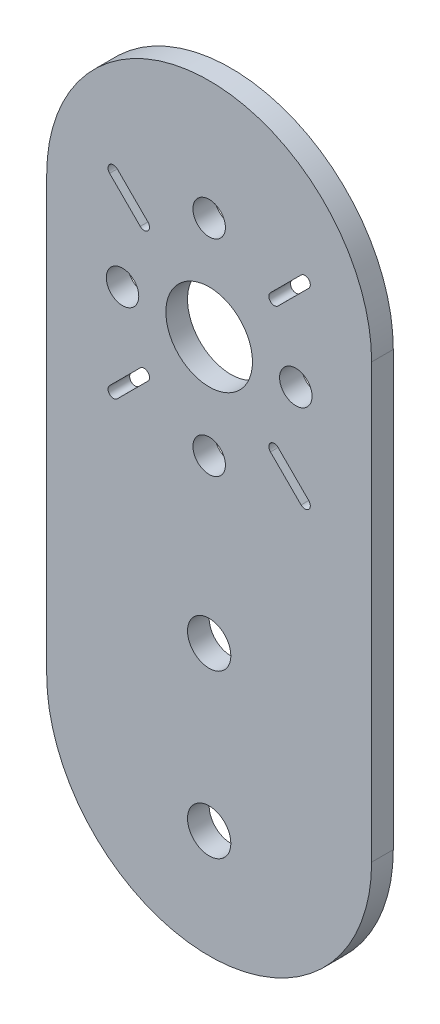
ISO-10303-21;
HEADER;
FILE_DESCRIPTION(('STEP AP214'),'2;1');
FILE_NAME('part.step','',(''),(''),'','','');
FILE_SCHEMA(('AUTOMOTIVE_DESIGN { 1 0 10303 214 1 1 1 1 }'));
ENDSEC;
DATA;
#1=APPLICATION_CONTEXT('core data for automotive mechanical design processes');
#2=APPLICATION_PROTOCOL_DEFINITION('international standard','automotive_design',2000,#1);
#3=PRODUCT_CONTEXT('',#1,'mechanical');
#4=PRODUCT('Part','Part','',(#3));
#5=PRODUCT_RELATED_PRODUCT_CATEGORY('part','',(#4));
#6=PRODUCT_DEFINITION_FORMATION('','',#4);
#7=PRODUCT_DEFINITION_CONTEXT('part definition',#1,'design');
#8=PRODUCT_DEFINITION('design','',#6,#7);
#9=PRODUCT_DEFINITION_SHAPE('','',#8);
#10=(LENGTH_UNIT() NAMED_UNIT(*) SI_UNIT(.MILLI.,.METRE.));
#11=(NAMED_UNIT(*) PLANE_ANGLE_UNIT() SI_UNIT($,.RADIAN.));
#12=(NAMED_UNIT(*) SI_UNIT($,.STERADIAN.) SOLID_ANGLE_UNIT());
#13=UNCERTAINTY_MEASURE_WITH_UNIT(LENGTH_MEASURE(1.E-05),#10,'distance_accuracy_value','');
#14=(GEOMETRIC_REPRESENTATION_CONTEXT(3) GLOBAL_UNCERTAINTY_ASSIGNED_CONTEXT((#13)) GLOBAL_UNIT_ASSIGNED_CONTEXT((#10,
#11,#12)) REPRESENTATION_CONTEXT('',''));
#15=CARTESIAN_POINT('',(0.,0.,0.));
#16=DIRECTION('',(0.,0.,1.));
#17=DIRECTION('',(1.,0.,0.));
#18=AXIS2_PLACEMENT_3D('',#15,#16,#17);
#19=CARTESIAN_POINT('',(0.,-20.,2.));
#20=DIRECTION('',(0.,0.,1.));
#21=DIRECTION('',(1.,0.,0.));
#22=AXIS2_PLACEMENT_3D('',#19,#20,#21);
#23=PLANE('',#22);
#24=CARTESIAN_POINT('',(8.,14.5,2.));
#25=DIRECTION('',(0.,0.,1.));
#26=DIRECTION('',(1.,0.,0.));
#27=AXIS2_PLACEMENT_3D('',#24,#25,#26);
#28=CIRCLE('',#27,1.5);
#29=CARTESIAN_POINT('',(9.5,14.5,2.));
#30=VERTEX_POINT('',#29);
#31=EDGE_CURVE('E362',#30,#30,#28,.T.);
#32=ORIENTED_EDGE('',*,*,#31,.F.);
#33=EDGE_LOOP('',(#32));
#34=FACE_BOUND('',#33,.T.);
#35=CARTESIAN_POINT('',(0.,24.,2.));
#36=DIRECTION('',(0.,0.,1.));
#37=DIRECTION('',(1.,0.,0.));
#38=AXIS2_PLACEMENT_3D('',#35,#36,#37);
#39=CIRCLE('',#38,1.5);
#40=CARTESIAN_POINT('',(1.5,24.,2.));
#41=VERTEX_POINT('',#40);
#42=EDGE_CURVE('E378',#41,#41,#39,.T.);
#43=ORIENTED_EDGE('',*,*,#42,.F.);
#44=EDGE_LOOP('',(#43));
#45=FACE_BOUND('',#44,.T.);
#46=CARTESIAN_POINT('',(0.,-10.,2.));
#47=DIRECTION('',(0.,0.,1.));
#48=DIRECTION('',(1.,0.,0.));
#49=AXIS2_PLACEMENT_3D('',#46,#47,#48);
#50=CIRCLE('',#49,2.);
#51=CARTESIAN_POINT('',(2.,-10.,2.));
#52=VERTEX_POINT('',#51);
#53=EDGE_CURVE('E394',#52,#52,#50,.T.);
#54=ORIENTED_EDGE('',*,*,#53,.F.);
#55=EDGE_LOOP('',(#54));
#56=FACE_BOUND('',#55,.T.);
#57=CARTESIAN_POINT('',(0.,-20.,2.));
#58=DIRECTION('',(0.,0.,1.));
#59=DIRECTION('',(1.,0.,0.));
#60=AXIS2_PLACEMENT_3D('',#57,#58,#59);
#61=CIRCLE('',#60,15.);
#62=CARTESIAN_POINT('',(-15.,-20.,2.));
#63=VERTEX_POINT('',#62);
#64=CARTESIAN_POINT('',(15.,-20.,2.));
#65=VERTEX_POINT('',#64);
#66=EDGE_CURVE('E410',#63,#65,#61,.T.);
#67=ORIENTED_EDGE('',*,*,#66,.T.);
#68=DIRECTION('',(0.,1.,0.));
#69=VECTOR('',#68,1.);
#70=CARTESIAN_POINT('',(15.,20.,2.));
#71=LINE('',#70,#69);
#72=CARTESIAN_POINT('',(15.,20.,2.));
#73=VERTEX_POINT('',#72);
#74=EDGE_CURVE('E414',#65,#73,#71,.T.);
#75=ORIENTED_EDGE('',*,*,#74,.T.);
#76=CARTESIAN_POINT('',(0.,20.,2.));
#77=DIRECTION('',(0.,0.,1.));
#78=DIRECTION('',(1.,0.,0.));
#79=AXIS2_PLACEMENT_3D('',#76,#77,#78);
#80=CIRCLE('',#79,15.);
#81=CARTESIAN_POINT('',(-15.,20.,2.));
#82=VERTEX_POINT('',#81);
#83=EDGE_CURVE('E418',#73,#82,#80,.T.);
#84=ORIENTED_EDGE('',*,*,#83,.T.);
#85=DIRECTION('',(0.,-1.,0.));
#86=VECTOR('',#85,1.);
#87=CARTESIAN_POINT('',(-15.,20.,2.));
#88=LINE('',#87,#86);
#89=EDGE_CURVE('E421',#82,#63,#88,.T.);
#90=ORIENTED_EDGE('',*,*,#89,.T.);
#91=EDGE_LOOP('',(#67,#75,#84,#90));
#92=FACE_BOUND('',#91,.T.);
#93=CARTESIAN_POINT('',(0.,-25.,2.));
#94=DIRECTION('',(0.,0.,1.));
#95=DIRECTION('',(1.,0.,0.));
#96=AXIS2_PLACEMENT_3D('',#93,#94,#95);
#97=CIRCLE('',#96,2.);
#98=CARTESIAN_POINT('',(2.,-25.,2.));
#99=VERTEX_POINT('',#98);
#100=EDGE_CURVE('E402',#99,#99,#97,.T.);
#101=ORIENTED_EDGE('',*,*,#100,.F.);
#102=EDGE_LOOP('',(#101));
#103=FACE_BOUND('',#102,.T.);
#104=CARTESIAN_POINT('',(0.,5.,2.));
#105=DIRECTION('',(0.,0.,1.));
#106=DIRECTION('',(1.,0.,0.));
#107=AXIS2_PLACEMENT_3D('',#104,#105,#106);
#108=CIRCLE('',#107,1.5);
#109=CARTESIAN_POINT('',(1.5,5.,2.));
#110=VERTEX_POINT('',#109);
#111=EDGE_CURVE('E386',#110,#110,#108,.T.);
#112=ORIENTED_EDGE('',*,*,#111,.F.);
#113=EDGE_LOOP('',(#112));
#114=FACE_BOUND('',#113,.T.);
#115=CARTESIAN_POINT('',(-8.,14.5,2.));
#116=DIRECTION('',(0.,0.,1.));
#117=DIRECTION('',(1.,0.,0.));
#118=AXIS2_PLACEMENT_3D('',#115,#116,#117);
#119=CIRCLE('',#118,1.5);
#120=CARTESIAN_POINT('',(-6.5,14.5,2.));
#121=VERTEX_POINT('',#120);
#122=EDGE_CURVE('E370',#121,#121,#119,.T.);
#123=ORIENTED_EDGE('',*,*,#122,.F.);
#124=EDGE_LOOP('',(#123));
#125=FACE_BOUND('',#124,.T.);
#126=CARTESIAN_POINT('',(0.,14.5,2.));
#127=DIRECTION('',(0.,0.,1.));
#128=DIRECTION('',(1.,0.,0.));
#129=AXIS2_PLACEMENT_3D('',#126,#127,#128);
#130=CIRCLE('',#129,4.);
#131=CARTESIAN_POINT('',(4.,14.5,2.));
#132=VERTEX_POINT('',#131);
#133=EDGE_CURVE('E354',#132,#132,#130,.T.);
#134=ORIENTED_EDGE('',*,*,#133,.F.);
#135=EDGE_LOOP('',(#134));
#136=FACE_BOUND('',#135,.T.);
#137=DIRECTION('',(0.707106781186548,0.707106781186547,0.));
#138=VECTOR('',#137,1.);
#139=CARTESIAN_POINT('',(6.36396103067893,20.1568542494924,2.));
#140=LINE('',#139,#138);
#141=CARTESIAN_POINT('',(6.36396103067893,20.1568542494924,2.));
#142=VERTEX_POINT('',#141);
#143=CARTESIAN_POINT('',(9.19238815542512,22.9852813742386,2.));
#144=VERTEX_POINT('',#143);
#145=EDGE_CURVE('E314',#142,#144,#140,.T.);
#146=ORIENTED_EDGE('',*,*,#145,.F.);
#147=CARTESIAN_POINT('',(6.01040764008565,20.5104076400856,2.));
#148=DIRECTION('',(0.,0.,1.));
#149=DIRECTION('',(1.,0.,0.));
#150=AXIS2_PLACEMENT_3D('',#147,#148,#149);
#151=CIRCLE('',#150,0.500000000000001);
#152=CARTESIAN_POINT('',(5.65685424949238,20.8639610306789,2.));
#153=VERTEX_POINT('',#152);
#154=EDGE_CURVE('E311',#153,#142,#151,.T.);
#155=ORIENTED_EDGE('',*,*,#154,.F.);
#156=DIRECTION('',(-0.707106781186548,-0.707106781186547,0.));
#157=VECTOR('',#156,1.);
#158=CARTESIAN_POINT('',(5.65685424949238,20.8639610306789,2.));
#159=LINE('',#158,#157);
#160=CARTESIAN_POINT('',(8.48528137423857,23.6923881554251,2.));
#161=VERTEX_POINT('',#160);
#162=EDGE_CURVE('E322',#161,#153,#159,.T.);
#163=ORIENTED_EDGE('',*,*,#162,.F.);
#164=CARTESIAN_POINT('',(8.83883476483185,23.3388347648318,2.));
#165=DIRECTION('',(0.,0.,1.));
#166=DIRECTION('',(1.,0.,0.));
#167=AXIS2_PLACEMENT_3D('',#164,#165,#166);
#168=CIRCLE('',#167,0.500000000000001);
#169=EDGE_CURVE('E318',#144,#161,#168,.T.);
#170=ORIENTED_EDGE('',*,*,#169,.F.);
#171=EDGE_LOOP('',(#146,#155,#163,#170));
#172=FACE_BOUND('',#171,.T.);
#173=DIRECTION('',(0.707106781186545,-0.70710678118655,0.));
#174=VECTOR('',#173,1.);
#175=CARTESIAN_POINT('',(5.65685424949252,8.13603896932105,2.));
#176=LINE('',#175,#174);
#177=CARTESIAN_POINT('',(5.65685424949252,8.13603896932105,2.));
#178=VERTEX_POINT('',#177);
#179=CARTESIAN_POINT('',(8.4852813742387,5.30761184457485,2.));
#180=VERTEX_POINT('',#179);
#181=EDGE_CURVE('E271',#178,#180,#176,.T.);
#182=ORIENTED_EDGE('',*,*,#181,.F.);
#183=CARTESIAN_POINT('',(6.01040764008579,8.48959235991432,2.));
#184=DIRECTION('',(0.,0.,1.));
#185=DIRECTION('',(1.,0.,0.));
#186=AXIS2_PLACEMENT_3D('',#183,#184,#185);
#187=CIRCLE('',#186,0.499999999999999);
#188=CARTESIAN_POINT('',(6.36396103067907,8.84314575050759,2.));
#189=VERTEX_POINT('',#188);
#190=EDGE_CURVE('E268',#189,#178,#187,.T.);
#191=ORIENTED_EDGE('',*,*,#190,.F.);
#192=DIRECTION('',(-0.707106781186545,0.70710678118655,0.));
#193=VECTOR('',#192,1.);
#194=CARTESIAN_POINT('',(6.36396103067907,8.84314575050759,2.));
#195=LINE('',#194,#193);
#196=CARTESIAN_POINT('',(9.19238815542525,6.01471862576139,2.));
#197=VERTEX_POINT('',#196);
#198=EDGE_CURVE('E279',#197,#189,#195,.T.);
#199=ORIENTED_EDGE('',*,*,#198,.F.);
#200=CARTESIAN_POINT('',(8.83883476483197,5.66116523516812,2.));
#201=DIRECTION('',(0.,0.,1.));
#202=DIRECTION('',(1.,0.,0.));
#203=AXIS2_PLACEMENT_3D('',#200,#201,#202);
#204=CIRCLE('',#203,0.499999999999999);
#205=EDGE_CURVE('E275',#180,#197,#204,.T.);
#206=ORIENTED_EDGE('',*,*,#205,.F.);
#207=EDGE_LOOP('',(#182,#191,#199,#206));
#208=FACE_BOUND('',#207,.T.);
#209=DIRECTION('',(-0.707106781186553,-0.707106781186542,0.));
#210=VECTOR('',#209,1.);
#211=CARTESIAN_POINT('',(-6.36396103067881,8.8431457505075,2.));
#212=LINE('',#211,#210);
#213=CARTESIAN_POINT('',(-6.36396103067881,8.8431457505075,2.));
#214=VERTEX_POINT('',#213);
#215=CARTESIAN_POINT('',(-9.19238815542502,6.01471862576133,2.));
#216=VERTEX_POINT('',#215);
#217=EDGE_CURVE('E228',#214,#216,#212,.T.);
#218=ORIENTED_EDGE('',*,*,#217,.F.);
#219=CARTESIAN_POINT('',(-6.01040764008554,8.48959235991422,2.));
#220=DIRECTION('',(0.,0.,1.));
#221=DIRECTION('',(1.,0.,0.));
#222=AXIS2_PLACEMENT_3D('',#219,#220,#221);
#223=CIRCLE('',#222,0.500000000000001);
#224=CARTESIAN_POINT('',(-5.65685424949226,8.13603896932094,2.));
#225=VERTEX_POINT('',#224);
#226=EDGE_CURVE('E225',#225,#214,#223,.T.);
#227=ORIENTED_EDGE('',*,*,#226,.F.);
#228=DIRECTION('',(0.707106781186553,0.707106781186542,0.));
#229=VECTOR('',#228,1.);
#230=CARTESIAN_POINT('',(-5.65685424949226,8.13603896932094,2.));
#231=LINE('',#230,#229);
#232=CARTESIAN_POINT('',(-8.48528137423847,5.30761184457478,2.));
#233=VERTEX_POINT('',#232);
#234=EDGE_CURVE('E236',#233,#225,#231,.T.);
#235=ORIENTED_EDGE('',*,*,#234,.F.);
#236=CARTESIAN_POINT('',(-8.83883476483175,5.66116523516805,2.));
#237=DIRECTION('',(0.,0.,1.));
#238=DIRECTION('',(1.,0.,0.));
#239=AXIS2_PLACEMENT_3D('',#236,#237,#238);
#240=CIRCLE('',#239,0.500000000000002);
#241=EDGE_CURVE('E232',#216,#233,#240,.T.);
#242=ORIENTED_EDGE('',*,*,#241,.F.);
#243=EDGE_LOOP('',(#218,#227,#235,#242));
#244=FACE_BOUND('',#243,.T.);
#245=DIRECTION('',(-0.70710678118654,0.707106781186555,0.));
#246=VECTOR('',#245,1.);
#247=CARTESIAN_POINT('',(-5.65685424949232,20.8639610306788,2.));
#248=LINE('',#247,#246);
#249=CARTESIAN_POINT('',(-5.65685424949232,20.8639610306788,2.));
#250=VERTEX_POINT('',#249);
#251=CARTESIAN_POINT('',(-8.48528137423847,23.692388155425,2.));
#252=VERTEX_POINT('',#251);
#253=EDGE_CURVE('E186',#250,#252,#248,.T.);
#254=ORIENTED_EDGE('',*,*,#253,.F.);
#255=CARTESIAN_POINT('',(-6.01040764008559,20.5104076400856,2.));
#256=DIRECTION('',(0.,0.,1.));
#257=DIRECTION('',(1.,0.,0.));
#258=AXIS2_PLACEMENT_3D('',#255,#256,#257);
#259=CIRCLE('',#258,0.499999999999999);
#260=CARTESIAN_POINT('',(-6.36396103067887,20.1568542494923,2.));
#261=VERTEX_POINT('',#260);
#262=EDGE_CURVE('E177',#261,#250,#259,.T.);
#263=ORIENTED_EDGE('',*,*,#262,.F.);
#264=DIRECTION('',(0.70710678118654,-0.707106781186555,0.));
#265=VECTOR('',#264,1.);
#266=CARTESIAN_POINT('',(-6.36396103067887,20.1568542494923,2.));
#267=LINE('',#266,#265);
#268=CARTESIAN_POINT('',(-9.19238815542503,22.9852813742385,2.));
#269=VERTEX_POINT('',#268);
#270=EDGE_CURVE('E203',#269,#261,#267,.T.);
#271=ORIENTED_EDGE('',*,*,#270,.F.);
#272=CARTESIAN_POINT('',(-8.83883476483175,23.3388347648318,2.));
#273=DIRECTION('',(0.,0.,1.));
#274=DIRECTION('',(1.,0.,0.));
#275=AXIS2_PLACEMENT_3D('',#272,#273,#274);
#276=CIRCLE('',#275,0.499999999999999);
#277=EDGE_CURVE('E199',#252,#269,#276,.T.);
#278=ORIENTED_EDGE('',*,*,#277,.F.);
#279=EDGE_LOOP('',(#254,#263,#271,#278));
#280=FACE_BOUND('',#279,.T.);
#281=ADVANCED_FACE('F39',(#34,#45,#56,#92,#103,#114,#125,#136,#172,#208,#244,#280),#23,.T.);
#282=CARTESIAN_POINT('',(0.,-20.,0.));
#283=DIRECTION('',(0.,0.,1.));
#284=DIRECTION('',(1.,0.,0.));
#285=AXIS2_PLACEMENT_3D('',#282,#283,#284);
#286=PLANE('',#285);
#287=CARTESIAN_POINT('',(-6.01040764008554,8.48959235991422,0.));
#288=DIRECTION('',(0.,0.,1.));
#289=DIRECTION('',(1.,0.,0.));
#290=AXIS2_PLACEMENT_3D('',#287,#288,#289);
#291=CIRCLE('',#290,0.500000000000001);
#292=CARTESIAN_POINT('',(-5.65685424949227,8.13603896932094,0.));
#293=VERTEX_POINT('',#292);
#294=CARTESIAN_POINT('',(-6.36396103067881,8.8431457505075,0.));
#295=VERTEX_POINT('',#294);
#296=EDGE_CURVE('E195',#293,#295,#291,.T.);
#297=ORIENTED_EDGE('',*,*,#296,.T.);
#298=DIRECTION('',(-0.707106781186553,-0.707106781186542,0.));
#299=VECTOR('',#298,1.);
#300=CARTESIAN_POINT('',(-6.36396103067881,8.8431457505075,0.));
#301=LINE('',#300,#299);
#302=CARTESIAN_POINT('',(-9.19238815542502,6.01471862576133,0.));
#303=VERTEX_POINT('',#302);
#304=EDGE_CURVE('E243',#295,#303,#301,.T.);
#305=ORIENTED_EDGE('',*,*,#304,.T.);
#306=CARTESIAN_POINT('',(-8.83883476483175,5.66116523516805,0.));
#307=DIRECTION('',(0.,0.,1.));
#308=DIRECTION('',(1.,0.,0.));
#309=AXIS2_PLACEMENT_3D('',#306,#307,#308);
#310=CIRCLE('',#309,0.500000000000002);
#311=CARTESIAN_POINT('',(-8.48528137423847,5.30761184457478,0.));
#312=VERTEX_POINT('',#311);
#313=EDGE_CURVE('E247',#303,#312,#310,.T.);
#314=ORIENTED_EDGE('',*,*,#313,.T.);
#315=DIRECTION('',(0.707106781186553,0.707106781186542,0.));
#316=VECTOR('',#315,1.);
#317=CARTESIAN_POINT('',(-5.65685424949226,8.13603896932094,0.));
#318=LINE('',#317,#316);
#319=EDGE_CURVE('E229',#312,#293,#318,.T.);
#320=ORIENTED_EDGE('',*,*,#319,.T.);
#321=EDGE_LOOP('',(#297,#305,#314,#320));
#322=FACE_BOUND('',#321,.T.);
#323=CARTESIAN_POINT('',(6.01040764008565,20.5104076400856,0.));
#324=DIRECTION('',(0.,0.,1.));
#325=DIRECTION('',(1.,0.,0.));
#326=AXIS2_PLACEMENT_3D('',#323,#324,#325);
#327=CIRCLE('',#326,0.500000000000001);
#328=CARTESIAN_POINT('',(5.65685424949238,20.8639610306789,0.));
#329=VERTEX_POINT('',#328);
#330=CARTESIAN_POINT('',(6.36396103067893,20.1568542494924,0.));
#331=VERTEX_POINT('',#330);
#332=EDGE_CURVE('E310',#329,#331,#327,.T.);
#333=ORIENTED_EDGE('',*,*,#332,.T.);
#334=DIRECTION('',(0.707106781186548,0.707106781186547,0.));
#335=VECTOR('',#334,1.);
#336=CARTESIAN_POINT('',(6.36396103067893,20.1568542494924,0.));
#337=LINE('',#336,#335);
#338=CARTESIAN_POINT('',(9.19238815542512,22.9852813742386,0.));
#339=VERTEX_POINT('',#338);
#340=EDGE_CURVE('E329',#331,#339,#337,.T.);
#341=ORIENTED_EDGE('',*,*,#340,.T.);
#342=CARTESIAN_POINT('',(8.83883476483185,23.3388347648318,0.));
#343=DIRECTION('',(0.,0.,1.));
#344=DIRECTION('',(1.,0.,0.));
#345=AXIS2_PLACEMENT_3D('',#342,#343,#344);
#346=CIRCLE('',#345,0.500000000000001);
#347=CARTESIAN_POINT('',(8.48528137423857,23.6923881554251,0.));
#348=VERTEX_POINT('',#347);
#349=EDGE_CURVE('E333',#339,#348,#346,.T.);
#350=ORIENTED_EDGE('',*,*,#349,.T.);
#351=DIRECTION('',(-0.707106781186548,-0.707106781186547,0.));
#352=VECTOR('',#351,1.);
#353=CARTESIAN_POINT('',(5.65685424949238,20.8639610306789,0.));
#354=LINE('',#353,#352);
#355=EDGE_CURVE('E315',#348,#329,#354,.T.);
#356=ORIENTED_EDGE('',*,*,#355,.T.);
#357=EDGE_LOOP('',(#333,#341,#350,#356));
#358=FACE_BOUND('',#357,.T.);
#359=CARTESIAN_POINT('',(0.,-20.,0.));
#360=DIRECTION('',(0.,0.,1.));
#361=DIRECTION('',(1.,0.,0.));
#362=AXIS2_PLACEMENT_3D('',#359,#360,#361);
#363=CIRCLE('',#362,15.);
#364=CARTESIAN_POINT('',(-15.,-20.,0.));
#365=VERTEX_POINT('',#364);
#366=CARTESIAN_POINT('',(15.,-20.,0.));
#367=VERTEX_POINT('',#366);
#368=EDGE_CURVE('E406',#365,#367,#363,.T.);
#369=ORIENTED_EDGE('',*,*,#368,.F.);
#370=DIRECTION('',(0.,-1.,0.));
#371=VECTOR('',#370,1.);
#372=CARTESIAN_POINT('',(-15.,20.,0.));
#373=LINE('',#372,#371);
#374=CARTESIAN_POINT('',(-15.,20.,0.));
#375=VERTEX_POINT('',#374);
#376=EDGE_CURVE('E415',#375,#365,#373,.T.);
#377=ORIENTED_EDGE('',*,*,#376,.F.);
#378=CARTESIAN_POINT('',(0.,20.,0.));
#379=DIRECTION('',(0.,0.,1.));
#380=DIRECTION('',(1.,0.,0.));
#381=AXIS2_PLACEMENT_3D('',#378,#379,#380);
#382=CIRCLE('',#381,15.);
#383=CARTESIAN_POINT('',(15.,20.,0.));
#384=VERTEX_POINT('',#383);
#385=EDGE_CURVE('E431',#384,#375,#382,.T.);
#386=ORIENTED_EDGE('',*,*,#385,.F.);
#387=DIRECTION('',(0.,1.,0.));
#388=VECTOR('',#387,1.);
#389=CARTESIAN_POINT('',(15.,20.,0.));
#390=LINE('',#389,#388);
#391=EDGE_CURVE('E428',#367,#384,#390,.T.);
#392=ORIENTED_EDGE('',*,*,#391,.F.);
#393=EDGE_LOOP('',(#369,#377,#386,#392));
#394=FACE_BOUND('',#393,.T.);
#395=CARTESIAN_POINT('',(0.,-25.,0.));
#396=DIRECTION('',(0.,0.,1.));
#397=DIRECTION('',(1.,0.,0.));
#398=AXIS2_PLACEMENT_3D('',#395,#396,#397);
#399=CIRCLE('',#398,2.);
#400=CARTESIAN_POINT('',(2.,-25.,0.));
#401=VERTEX_POINT('',#400);
#402=EDGE_CURVE('E398',#401,#401,#399,.T.);
#403=ORIENTED_EDGE('',*,*,#402,.T.);
#404=EDGE_LOOP('',(#403));
#405=FACE_BOUND('',#404,.T.);
#406=CARTESIAN_POINT('',(0.,-10.,0.));
#407=DIRECTION('',(0.,0.,1.));
#408=DIRECTION('',(1.,0.,0.));
#409=AXIS2_PLACEMENT_3D('',#406,#407,#408);
#410=CIRCLE('',#409,2.);
#411=CARTESIAN_POINT('',(2.,-10.,0.));
#412=VERTEX_POINT('',#411);
#413=EDGE_CURVE('E390',#412,#412,#410,.T.);
#414=ORIENTED_EDGE('',*,*,#413,.T.);
#415=EDGE_LOOP('',(#414));
#416=FACE_BOUND('',#415,.T.);
#417=CARTESIAN_POINT('',(0.,5.,0.));
#418=DIRECTION('',(0.,0.,1.));
#419=DIRECTION('',(1.,0.,0.));
#420=AXIS2_PLACEMENT_3D('',#417,#418,#419);
#421=CIRCLE('',#420,1.5);
#422=CARTESIAN_POINT('',(1.5,5.,0.));
#423=VERTEX_POINT('',#422);
#424=EDGE_CURVE('E382',#423,#423,#421,.T.);
#425=ORIENTED_EDGE('',*,*,#424,.T.);
#426=EDGE_LOOP('',(#425));
#427=FACE_BOUND('',#426,.T.);
#428=CARTESIAN_POINT('',(0.,24.,0.));
#429=DIRECTION('',(0.,0.,1.));
#430=DIRECTION('',(1.,0.,0.));
#431=AXIS2_PLACEMENT_3D('',#428,#429,#430);
#432=CIRCLE('',#431,1.5);
#433=CARTESIAN_POINT('',(1.5,24.,0.));
#434=VERTEX_POINT('',#433);
#435=EDGE_CURVE('E374',#434,#434,#432,.T.);
#436=ORIENTED_EDGE('',*,*,#435,.T.);
#437=EDGE_LOOP('',(#436));
#438=FACE_BOUND('',#437,.T.);
#439=CARTESIAN_POINT('',(-8.,14.5,0.));
#440=DIRECTION('',(0.,0.,1.));
#441=DIRECTION('',(1.,0.,0.));
#442=AXIS2_PLACEMENT_3D('',#439,#440,#441);
#443=CIRCLE('',#442,1.5);
#444=CARTESIAN_POINT('',(-6.5,14.5,0.));
#445=VERTEX_POINT('',#444);
#446=EDGE_CURVE('E366',#445,#445,#443,.T.);
#447=ORIENTED_EDGE('',*,*,#446,.T.);
#448=EDGE_LOOP('',(#447));
#449=FACE_BOUND('',#448,.T.);
#450=CARTESIAN_POINT('',(8.,14.5,0.));
#451=DIRECTION('',(0.,0.,1.));
#452=DIRECTION('',(1.,0.,0.));
#453=AXIS2_PLACEMENT_3D('',#450,#451,#452);
#454=CIRCLE('',#453,1.5);
#455=CARTESIAN_POINT('',(9.5,14.5,0.));
#456=VERTEX_POINT('',#455);
#457=EDGE_CURVE('E358',#456,#456,#454,.T.);
#458=ORIENTED_EDGE('',*,*,#457,.T.);
#459=EDGE_LOOP('',(#458));
#460=FACE_BOUND('',#459,.T.);
#461=CARTESIAN_POINT('',(0.,14.5,0.));
#462=DIRECTION('',(0.,0.,1.));
#463=DIRECTION('',(1.,0.,0.));
#464=AXIS2_PLACEMENT_3D('',#461,#462,#463);
#465=CIRCLE('',#464,4.);
#466=CARTESIAN_POINT('',(4.,14.5,0.));
#467=VERTEX_POINT('',#466);
#468=EDGE_CURVE('E353',#467,#467,#465,.T.);
#469=ORIENTED_EDGE('',*,*,#468,.T.);
#470=EDGE_LOOP('',(#469));
#471=FACE_BOUND('',#470,.T.);
#472=CARTESIAN_POINT('',(6.01040764008579,8.48959235991432,0.));
#473=DIRECTION('',(0.,0.,1.));
#474=DIRECTION('',(1.,0.,0.));
#475=AXIS2_PLACEMENT_3D('',#472,#473,#474);
#476=CIRCLE('',#475,0.499999999999999);
#477=CARTESIAN_POINT('',(6.36396103067907,8.84314575050759,0.));
#478=VERTEX_POINT('',#477);
#479=CARTESIAN_POINT('',(5.65685424949252,8.13603896932105,0.));
#480=VERTEX_POINT('',#479);
#481=EDGE_CURVE('E267',#478,#480,#476,.T.);
#482=ORIENTED_EDGE('',*,*,#481,.T.);
#483=DIRECTION('',(0.707106781186545,-0.70710678118655,0.));
#484=VECTOR('',#483,1.);
#485=CARTESIAN_POINT('',(5.65685424949252,8.13603896932105,0.));
#486=LINE('',#485,#484);
#487=CARTESIAN_POINT('',(8.4852813742387,5.30761184457485,0.));
#488=VERTEX_POINT('',#487);
#489=EDGE_CURVE('E286',#480,#488,#486,.T.);
#490=ORIENTED_EDGE('',*,*,#489,.T.);
#491=CARTESIAN_POINT('',(8.83883476483197,5.66116523516812,0.));
#492=DIRECTION('',(0.,0.,1.));
#493=DIRECTION('',(1.,0.,0.));
#494=AXIS2_PLACEMENT_3D('',#491,#492,#493);
#495=CIRCLE('',#494,0.499999999999999);
#496=CARTESIAN_POINT('',(9.19238815542525,6.01471862576139,0.));
#497=VERTEX_POINT('',#496);
#498=EDGE_CURVE('E290',#488,#497,#495,.T.);
#499=ORIENTED_EDGE('',*,*,#498,.T.);
#500=DIRECTION('',(-0.707106781186545,0.70710678118655,0.));
#501=VECTOR('',#500,1.);
#502=CARTESIAN_POINT('',(6.36396103067907,8.84314575050759,0.));
#503=LINE('',#502,#501);
#504=EDGE_CURVE('E272',#497,#478,#503,.T.);
#505=ORIENTED_EDGE('',*,*,#504,.T.);
#506=EDGE_LOOP('',(#482,#490,#499,#505));
#507=FACE_BOUND('',#506,.T.);
#508=CARTESIAN_POINT('',(-6.01040764008559,20.5104076400856,0.));
#509=DIRECTION('',(0.,0.,1.));
#510=DIRECTION('',(1.,0.,0.));
#511=AXIS2_PLACEMENT_3D('',#508,#509,#510);
#512=CIRCLE('',#511,0.499999999999999);
#513=CARTESIAN_POINT('',(-6.36396103067888,20.1568542494923,0.));
#514=VERTEX_POINT('',#513);
#515=CARTESIAN_POINT('',(-5.65685424949232,20.8639610306788,0.));
#516=VERTEX_POINT('',#515);
#517=EDGE_CURVE('E63',#514,#516,#512,.T.);
#518=ORIENTED_EDGE('',*,*,#517,.T.);
#519=DIRECTION('',(-0.70710678118654,0.707106781186555,0.));
#520=VECTOR('',#519,1.);
#521=CARTESIAN_POINT('',(-5.65685424949232,20.8639610306788,0.));
#522=LINE('',#521,#520);
#523=CARTESIAN_POINT('',(-8.48528137423847,23.692388155425,0.));
#524=VERTEX_POINT('',#523);
#525=EDGE_CURVE('E193',#516,#524,#522,.T.);
#526=ORIENTED_EDGE('',*,*,#525,.T.);
#527=CARTESIAN_POINT('',(-8.83883476483175,23.3388347648318,0.));
#528=DIRECTION('',(0.,0.,1.));
#529=DIRECTION('',(1.,0.,0.));
#530=AXIS2_PLACEMENT_3D('',#527,#528,#529);
#531=CIRCLE('',#530,0.499999999999999);
#532=CARTESIAN_POINT('',(-9.19238815542503,22.9852813742385,0.));
#533=VERTEX_POINT('',#532);
#534=EDGE_CURVE('E212',#524,#533,#531,.T.);
#535=ORIENTED_EDGE('',*,*,#534,.T.);
#536=DIRECTION('',(0.70710678118654,-0.707106781186555,0.));
#537=VECTOR('',#536,1.);
#538=CARTESIAN_POINT('',(-6.36396103067887,20.1568542494923,0.));
#539=LINE('',#538,#537);
#540=EDGE_CURVE('E187',#533,#514,#539,.T.);
#541=ORIENTED_EDGE('',*,*,#540,.T.);
#542=EDGE_LOOP('',(#518,#526,#535,#541));
#543=FACE_BOUND('',#542,.T.);
#544=ADVANCED_FACE('F454',(#322,#358,#394,#405,#416,#427,#438,#449,#460,#471,#507,#543),#286,.F.);
#545=CARTESIAN_POINT('',(0.,-20.,2.));
#546=DIRECTION('',(0.,0.,-1.));
#547=DIRECTION('',(-1.,0.,0.));
#548=AXIS2_PLACEMENT_3D('',#545,#546,#547);
#549=CYLINDRICAL_SURFACE('',#548,15.);
#550=ORIENTED_EDGE('',*,*,#368,.T.);
#551=DIRECTION('',(0.,0.,-1.));
#552=VECTOR('',#551,1.);
#553=CARTESIAN_POINT('',(15.,-20.,2.));
#554=LINE('',#553,#552);
#555=EDGE_CURVE('E11',#65,#367,#554,.T.);
#556=ORIENTED_EDGE('',*,*,#555,.F.);
#557=ORIENTED_EDGE('',*,*,#66,.F.);
#558=DIRECTION('',(0.,0.,-1.));
#559=VECTOR('',#558,1.);
#560=CARTESIAN_POINT('',(-15.,-20.,2.));
#561=LINE('',#560,#559);
#562=EDGE_CURVE('E424',#63,#365,#561,.T.);
#563=ORIENTED_EDGE('',*,*,#562,.T.);
#564=EDGE_LOOP('',(#550,#556,#557,#563));
#565=FACE_BOUND('',#564,.T.);
#566=ADVANCED_FACE('F41',(#565),#549,.T.);
#567=CARTESIAN_POINT('',(15.,20.,2.));
#568=DIRECTION('',(-1.,0.,0.));
#569=DIRECTION('',(0.,-1.,0.));
#570=AXIS2_PLACEMENT_3D('',#567,#568,#569);
#571=PLANE('',#570);
#572=ORIENTED_EDGE('',*,*,#391,.T.);
#573=DIRECTION('',(0.,0.,-1.));
#574=VECTOR('',#573,1.);
#575=CARTESIAN_POINT('',(15.,20.,2.));
#576=LINE('',#575,#574);
#577=EDGE_CURVE('E48',#73,#384,#576,.T.);
#578=ORIENTED_EDGE('',*,*,#577,.F.);
#579=ORIENTED_EDGE('',*,*,#74,.F.);
#580=ORIENTED_EDGE('',*,*,#555,.T.);
#581=EDGE_LOOP('',(#572,#578,#579,#580));
#582=FACE_BOUND('',#581,.T.);
#583=ADVANCED_FACE('F465',(#582),#571,.F.);
#584=CARTESIAN_POINT('',(0.,20.,2.));
#585=DIRECTION('',(0.,0.,-1.));
#586=DIRECTION('',(-1.,0.,0.));
#587=AXIS2_PLACEMENT_3D('',#584,#585,#586);
#588=CYLINDRICAL_SURFACE('',#587,15.);
#589=ORIENTED_EDGE('',*,*,#385,.T.);
#590=DIRECTION('',(0.,0.,-1.));
#591=VECTOR('',#590,1.);
#592=CARTESIAN_POINT('',(-15.,20.,2.));
#593=LINE('',#592,#591);
#594=EDGE_CURVE('E439',#82,#375,#593,.T.);
#595=ORIENTED_EDGE('',*,*,#594,.F.);
#596=ORIENTED_EDGE('',*,*,#83,.F.);
#597=ORIENTED_EDGE('',*,*,#577,.T.);
#598=EDGE_LOOP('',(#589,#595,#596,#597));
#599=FACE_BOUND('',#598,.T.);
#600=ADVANCED_FACE('F448',(#599),#588,.T.);
#601=CARTESIAN_POINT('',(-15.,20.,2.));
#602=DIRECTION('',(1.,0.,0.));
#603=DIRECTION('',(0.,1.,0.));
#604=AXIS2_PLACEMENT_3D('',#601,#602,#603);
#605=PLANE('',#604);
#606=ORIENTED_EDGE('',*,*,#376,.T.);
#607=ORIENTED_EDGE('',*,*,#562,.F.);
#608=ORIENTED_EDGE('',*,*,#89,.F.);
#609=ORIENTED_EDGE('',*,*,#594,.T.);
#610=EDGE_LOOP('',(#606,#607,#608,#609));
#611=FACE_BOUND('',#610,.T.);
#612=ADVANCED_FACE('F458',(#611),#605,.F.);
#613=CARTESIAN_POINT('',(0.,-25.,2.));
#614=DIRECTION('',(0.,0.,-1.));
#615=DIRECTION('',(-1.,0.,0.));
#616=AXIS2_PLACEMENT_3D('',#613,#614,#615);
#617=CYLINDRICAL_SURFACE('',#616,2.);
#618=ORIENTED_EDGE('',*,*,#100,.T.);
#619=EDGE_LOOP('',(#618));
#620=FACE_BOUND('',#619,.T.);
#621=ORIENTED_EDGE('',*,*,#402,.F.);
#622=EDGE_LOOP('',(#621));
#623=FACE_BOUND('',#622,.T.);
#624=ADVANCED_FACE('F483',(#620,#623),#617,.F.);
#625=CARTESIAN_POINT('',(0.,-10.,2.));
#626=DIRECTION('',(0.,0.,-1.));
#627=DIRECTION('',(-1.,0.,0.));
#628=AXIS2_PLACEMENT_3D('',#625,#626,#627);
#629=CYLINDRICAL_SURFACE('',#628,2.);
#630=ORIENTED_EDGE('',*,*,#53,.T.);
#631=EDGE_LOOP('',(#630));
#632=FACE_BOUND('',#631,.T.);
#633=ORIENTED_EDGE('',*,*,#413,.F.);
#634=EDGE_LOOP('',(#633));
#635=FACE_BOUND('',#634,.T.);
#636=ADVANCED_FACE('F490',(#632,#635),#629,.F.);
#637=CARTESIAN_POINT('',(0.,5.,2.));
#638=DIRECTION('',(0.,0.,-1.));
#639=DIRECTION('',(-1.,0.,0.));
#640=AXIS2_PLACEMENT_3D('',#637,#638,#639);
#641=CYLINDRICAL_SURFACE('',#640,1.5);
#642=ORIENTED_EDGE('',*,*,#111,.T.);
#643=EDGE_LOOP('',(#642));
#644=FACE_BOUND('',#643,.T.);
#645=ORIENTED_EDGE('',*,*,#424,.F.);
#646=EDGE_LOOP('',(#645));
#647=FACE_BOUND('',#646,.T.);
#648=ADVANCED_FACE('F495',(#644,#647),#641,.F.);
#649=CARTESIAN_POINT('',(0.,24.,2.));
#650=DIRECTION('',(0.,0.,-1.));
#651=DIRECTION('',(-1.,0.,0.));
#652=AXIS2_PLACEMENT_3D('',#649,#650,#651);
#653=CYLINDRICAL_SURFACE('',#652,1.5);
#654=ORIENTED_EDGE('',*,*,#42,.T.);
#655=EDGE_LOOP('',(#654));
#656=FACE_BOUND('',#655,.T.);
#657=ORIENTED_EDGE('',*,*,#435,.F.);
#658=EDGE_LOOP('',(#657));
#659=FACE_BOUND('',#658,.T.);
#660=ADVANCED_FACE('F588',(#656,#659),#653,.F.);
#661=CARTESIAN_POINT('',(-8.,14.5,2.));
#662=DIRECTION('',(0.,0.,-1.));
#663=DIRECTION('',(-1.,0.,0.));
#664=AXIS2_PLACEMENT_3D('',#661,#662,#663);
#665=CYLINDRICAL_SURFACE('',#664,1.5);
#666=ORIENTED_EDGE('',*,*,#122,.T.);
#667=EDGE_LOOP('',(#666));
#668=FACE_BOUND('',#667,.T.);
#669=ORIENTED_EDGE('',*,*,#446,.F.);
#670=EDGE_LOOP('',(#669));
#671=FACE_BOUND('',#670,.T.);
#672=ADVANCED_FACE('F584',(#668,#671),#665,.F.);
#673=CARTESIAN_POINT('',(8.,14.5,2.));
#674=DIRECTION('',(0.,0.,-1.));
#675=DIRECTION('',(-1.,0.,0.));
#676=AXIS2_PLACEMENT_3D('',#673,#674,#675);
#677=CYLINDRICAL_SURFACE('',#676,1.5);
#678=ORIENTED_EDGE('',*,*,#31,.T.);
#679=EDGE_LOOP('',(#678));
#680=FACE_BOUND('',#679,.T.);
#681=ORIENTED_EDGE('',*,*,#457,.F.);
#682=EDGE_LOOP('',(#681));
#683=FACE_BOUND('',#682,.T.);
#684=ADVANCED_FACE('F580',(#680,#683),#677,.F.);
#685=CARTESIAN_POINT('',(0.,14.5,2.));
#686=DIRECTION('',(0.,0.,-1.));
#687=DIRECTION('',(-1.,0.,0.));
#688=AXIS2_PLACEMENT_3D('',#685,#686,#687);
#689=CYLINDRICAL_SURFACE('',#688,4.);
#690=ORIENTED_EDGE('',*,*,#133,.T.);
#691=EDGE_LOOP('',(#690));
#692=FACE_BOUND('',#691,.T.);
#693=ORIENTED_EDGE('',*,*,#468,.F.);
#694=EDGE_LOOP('',(#693));
#695=FACE_BOUND('',#694,.T.);
#696=ADVANCED_FACE('F576',(#692,#695),#689,.F.);
#697=CARTESIAN_POINT('',(6.01040764008565,20.5104076400856,2.));
#698=DIRECTION('',(0.,0.,-1.));
#699=DIRECTION('',(-1.,0.,0.));
#700=AXIS2_PLACEMENT_3D('',#697,#698,#699);
#701=CYLINDRICAL_SURFACE('',#700,0.500000000000001);
#702=ORIENTED_EDGE('',*,*,#332,.F.);
#703=DIRECTION('',(0.,0.,-1.));
#704=VECTOR('',#703,1.);
#705=CARTESIAN_POINT('',(5.65685424949238,20.8639610306789,2.));
#706=LINE('',#705,#704);
#707=EDGE_CURVE('E325',#153,#329,#706,.T.);
#708=ORIENTED_EDGE('',*,*,#707,.F.);
#709=ORIENTED_EDGE('',*,*,#154,.T.);
#710=DIRECTION('',(0.,0.,-1.));
#711=VECTOR('',#710,1.);
#712=CARTESIAN_POINT('',(6.36396103067893,20.1568542494924,2.));
#713=LINE('',#712,#711);
#714=EDGE_CURVE('E349',#142,#331,#713,.T.);
#715=ORIENTED_EDGE('',*,*,#714,.T.);
#716=EDGE_LOOP('',(#702,#708,#709,#715));
#717=FACE_BOUND('',#716,.T.);
#718=ADVANCED_FACE('F572',(#717),#701,.F.);
#719=CARTESIAN_POINT('',(6.36396103067893,20.1568542494924,2.));
#720=DIRECTION('',(-0.707106781186547,0.707106781186548,0.));
#721=DIRECTION('',(-0.707106781186548,-0.707106781186547,0.));
#722=AXIS2_PLACEMENT_3D('',#719,#720,#721);
#723=PLANE('',#722);
#724=ORIENTED_EDGE('',*,*,#340,.F.);
#725=ORIENTED_EDGE('',*,*,#714,.F.);
#726=ORIENTED_EDGE('',*,*,#145,.T.);
#727=DIRECTION('',(0.,0.,-1.));
#728=VECTOR('',#727,1.);
#729=CARTESIAN_POINT('',(9.19238815542512,22.9852813742386,2.));
#730=LINE('',#729,#728);
#731=EDGE_CURVE('E346',#144,#339,#730,.T.);
#732=ORIENTED_EDGE('',*,*,#731,.T.);
#733=EDGE_LOOP('',(#724,#725,#726,#732));
#734=FACE_BOUND('',#733,.T.);
#735=ADVANCED_FACE('F568',(#734),#723,.T.);
#736=CARTESIAN_POINT('',(8.83883476483185,23.3388347648318,2.));
#737=DIRECTION('',(0.,0.,-1.));
#738=DIRECTION('',(-1.,0.,0.));
#739=AXIS2_PLACEMENT_3D('',#736,#737,#738);
#740=CYLINDRICAL_SURFACE('',#739,0.500000000000001);
#741=ORIENTED_EDGE('',*,*,#349,.F.);
#742=ORIENTED_EDGE('',*,*,#731,.F.);
#743=ORIENTED_EDGE('',*,*,#169,.T.);
#744=DIRECTION('',(0.,0.,-1.));
#745=VECTOR('',#744,1.);
#746=CARTESIAN_POINT('',(8.48528137423857,23.6923881554251,2.));
#747=LINE('',#746,#745);
#748=EDGE_CURVE('E343',#161,#348,#747,.T.);
#749=ORIENTED_EDGE('',*,*,#748,.T.);
#750=EDGE_LOOP('',(#741,#742,#743,#749));
#751=FACE_BOUND('',#750,.T.);
#752=ADVANCED_FACE('F564',(#751),#740,.F.);
#753=CARTESIAN_POINT('',(5.65685424949238,20.8639610306789,2.));
#754=DIRECTION('',(0.707106781186547,-0.707106781186548,0.));
#755=DIRECTION('',(0.707106781186548,0.707106781186547,0.));
#756=AXIS2_PLACEMENT_3D('',#753,#754,#755);
#757=PLANE('',#756);
#758=ORIENTED_EDGE('',*,*,#355,.F.);
#759=ORIENTED_EDGE('',*,*,#748,.F.);
#760=ORIENTED_EDGE('',*,*,#162,.T.);
#761=ORIENTED_EDGE('',*,*,#707,.T.);
#762=EDGE_LOOP('',(#758,#759,#760,#761));
#763=FACE_BOUND('',#762,.T.);
#764=ADVANCED_FACE('F560',(#763),#757,.T.);
#765=CARTESIAN_POINT('',(6.01040764008579,8.48959235991432,2.));
#766=DIRECTION('',(0.,0.,-1.));
#767=DIRECTION('',(-1.,0.,0.));
#768=AXIS2_PLACEMENT_3D('',#765,#766,#767);
#769=CYLINDRICAL_SURFACE('',#768,0.499999999999999);
#770=ORIENTED_EDGE('',*,*,#481,.F.);
#771=DIRECTION('',(0.,0.,-1.));
#772=VECTOR('',#771,1.);
#773=CARTESIAN_POINT('',(6.36396103067907,8.84314575050759,2.));
#774=LINE('',#773,#772);
#775=EDGE_CURVE('E282',#189,#478,#774,.T.);
#776=ORIENTED_EDGE('',*,*,#775,.F.);
#777=ORIENTED_EDGE('',*,*,#190,.T.);
#778=DIRECTION('',(0.,0.,-1.));
#779=VECTOR('',#778,1.);
#780=CARTESIAN_POINT('',(5.65685424949252,8.13603896932105,2.));
#781=LINE('',#780,#779);
#782=EDGE_CURVE('E306',#178,#480,#781,.T.);
#783=ORIENTED_EDGE('',*,*,#782,.T.);
#784=EDGE_LOOP('',(#770,#776,#777,#783));
#785=FACE_BOUND('',#784,.T.);
#786=ADVANCED_FACE('F556',(#785),#769,.F.);
#787=CARTESIAN_POINT('',(5.65685424949252,8.13603896932105,2.));
#788=DIRECTION('',(0.70710678118655,0.707106781186545,0.));
#789=DIRECTION('',(-0.707106781186545,0.70710678118655,0.));
#790=AXIS2_PLACEMENT_3D('',#787,#788,#789);
#791=PLANE('',#790);
#792=ORIENTED_EDGE('',*,*,#489,.F.);
#793=ORIENTED_EDGE('',*,*,#782,.F.);
#794=ORIENTED_EDGE('',*,*,#181,.T.);
#795=DIRECTION('',(0.,0.,-1.));
#796=VECTOR('',#795,1.);
#797=CARTESIAN_POINT('',(8.4852813742387,5.30761184457485,2.));
#798=LINE('',#797,#796);
#799=EDGE_CURVE('E303',#180,#488,#798,.T.);
#800=ORIENTED_EDGE('',*,*,#799,.T.);
#801=EDGE_LOOP('',(#792,#793,#794,#800));
#802=FACE_BOUND('',#801,.T.);
#803=ADVANCED_FACE('F552',(#802),#791,.T.);
#804=CARTESIAN_POINT('',(8.83883476483197,5.66116523516812,2.));
#805=DIRECTION('',(0.,0.,-1.));
#806=DIRECTION('',(-1.,0.,0.));
#807=AXIS2_PLACEMENT_3D('',#804,#805,#806);
#808=CYLINDRICAL_SURFACE('',#807,0.499999999999999);
#809=ORIENTED_EDGE('',*,*,#498,.F.);
#810=ORIENTED_EDGE('',*,*,#799,.F.);
#811=ORIENTED_EDGE('',*,*,#205,.T.);
#812=DIRECTION('',(0.,0.,-1.));
#813=VECTOR('',#812,1.);
#814=CARTESIAN_POINT('',(9.19238815542525,6.01471862576139,2.));
#815=LINE('',#814,#813);
#816=EDGE_CURVE('E300',#197,#497,#815,.T.);
#817=ORIENTED_EDGE('',*,*,#816,.T.);
#818=EDGE_LOOP('',(#809,#810,#811,#817));
#819=FACE_BOUND('',#818,.T.);
#820=ADVANCED_FACE('F548',(#819),#808,.F.);
#821=CARTESIAN_POINT('',(6.36396103067907,8.84314575050759,2.));
#822=DIRECTION('',(-0.70710678118655,-0.707106781186545,0.));
#823=DIRECTION('',(0.707106781186545,-0.70710678118655,0.));
#824=AXIS2_PLACEMENT_3D('',#821,#822,#823);
#825=PLANE('',#824);
#826=ORIENTED_EDGE('',*,*,#504,.F.);
#827=ORIENTED_EDGE('',*,*,#816,.F.);
#828=ORIENTED_EDGE('',*,*,#198,.T.);
#829=ORIENTED_EDGE('',*,*,#775,.T.);
#830=EDGE_LOOP('',(#826,#827,#828,#829));
#831=FACE_BOUND('',#830,.T.);
#832=ADVANCED_FACE('F544',(#831),#825,.T.);
#833=CARTESIAN_POINT('',(-6.01040764008554,8.48959235991422,2.));
#834=DIRECTION('',(0.,0.,-1.));
#835=DIRECTION('',(-1.,0.,0.));
#836=AXIS2_PLACEMENT_3D('',#833,#834,#835);
#837=CYLINDRICAL_SURFACE('',#836,0.500000000000001);
#838=ORIENTED_EDGE('',*,*,#296,.F.);
#839=DIRECTION('',(0.,0.,-1.));
#840=VECTOR('',#839,1.);
#841=CARTESIAN_POINT('',(-5.65685424949226,8.13603896932094,2.));
#842=LINE('',#841,#840);
#843=EDGE_CURVE('E239',#225,#293,#842,.T.);
#844=ORIENTED_EDGE('',*,*,#843,.F.);
#845=ORIENTED_EDGE('',*,*,#226,.T.);
#846=DIRECTION('',(0.,0.,-1.));
#847=VECTOR('',#846,1.);
#848=CARTESIAN_POINT('',(-6.36396103067881,8.8431457505075,2.));
#849=LINE('',#848,#847);
#850=EDGE_CURVE('E263',#214,#295,#849,.T.);
#851=ORIENTED_EDGE('',*,*,#850,.T.);
#852=EDGE_LOOP('',(#838,#844,#845,#851));
#853=FACE_BOUND('',#852,.T.);
#854=ADVANCED_FACE('F540',(#853),#837,.F.);
#855=CARTESIAN_POINT('',(-6.36396103067881,8.8431457505075,2.));
#856=DIRECTION('',(0.707106781186542,-0.707106781186553,0.));
#857=DIRECTION('',(0.707106781186553,0.707106781186542,0.));
#858=AXIS2_PLACEMENT_3D('',#855,#856,#857);
#859=PLANE('',#858);
#860=ORIENTED_EDGE('',*,*,#304,.F.);
#861=ORIENTED_EDGE('',*,*,#850,.F.);
#862=ORIENTED_EDGE('',*,*,#217,.T.);
#863=DIRECTION('',(0.,0.,-1.));
#864=VECTOR('',#863,1.);
#865=CARTESIAN_POINT('',(-9.19238815542502,6.01471862576133,2.));
#866=LINE('',#865,#864);
#867=EDGE_CURVE('E260',#216,#303,#866,.T.);
#868=ORIENTED_EDGE('',*,*,#867,.T.);
#869=EDGE_LOOP('',(#860,#861,#862,#868));
#870=FACE_BOUND('',#869,.T.);
#871=ADVANCED_FACE('F536',(#870),#859,.T.);
#872=CARTESIAN_POINT('',(-8.83883476483175,5.66116523516805,2.));
#873=DIRECTION('',(0.,0.,-1.));
#874=DIRECTION('',(-1.,0.,0.));
#875=AXIS2_PLACEMENT_3D('',#872,#873,#874);
#876=CYLINDRICAL_SURFACE('',#875,0.500000000000002);
#877=ORIENTED_EDGE('',*,*,#313,.F.);
#878=ORIENTED_EDGE('',*,*,#867,.F.);
#879=ORIENTED_EDGE('',*,*,#241,.T.);
#880=DIRECTION('',(0.,0.,-1.));
#881=VECTOR('',#880,1.);
#882=CARTESIAN_POINT('',(-8.48528137423847,5.30761184457478,2.));
#883=LINE('',#882,#881);
#884=EDGE_CURVE('E257',#233,#312,#883,.T.);
#885=ORIENTED_EDGE('',*,*,#884,.T.);
#886=EDGE_LOOP('',(#877,#878,#879,#885));
#887=FACE_BOUND('',#886,.T.);
#888=ADVANCED_FACE('F532',(#887),#876,.F.);
#889=CARTESIAN_POINT('',(-5.65685424949226,8.13603896932094,2.));
#890=DIRECTION('',(-0.707106781186543,0.707106781186553,0.));
#891=DIRECTION('',(-0.707106781186553,-0.707106781186543,0.));
#892=AXIS2_PLACEMENT_3D('',#889,#890,#891);
#893=PLANE('',#892);
#894=ORIENTED_EDGE('',*,*,#319,.F.);
#895=ORIENTED_EDGE('',*,*,#884,.F.);
#896=ORIENTED_EDGE('',*,*,#234,.T.);
#897=ORIENTED_EDGE('',*,*,#843,.T.);
#898=EDGE_LOOP('',(#894,#895,#896,#897));
#899=FACE_BOUND('',#898,.T.);
#900=ADVANCED_FACE('F529',(#899),#893,.T.);
#901=CARTESIAN_POINT('',(-6.01040764008559,20.5104076400856,2.));
#902=DIRECTION('',(0.,0.,-1.));
#903=DIRECTION('',(-1.,0.,0.));
#904=AXIS2_PLACEMENT_3D('',#901,#902,#903);
#905=CYLINDRICAL_SURFACE('',#904,0.499999999999999);
#906=ORIENTED_EDGE('',*,*,#517,.F.);
#907=DIRECTION('',(0.,0.,-1.));
#908=VECTOR('',#907,1.);
#909=CARTESIAN_POINT('',(-6.36396103067887,20.1568542494923,2.));
#910=LINE('',#909,#908);
#911=EDGE_CURVE('E181',#261,#514,#910,.T.);
#912=ORIENTED_EDGE('',*,*,#911,.F.);
#913=ORIENTED_EDGE('',*,*,#262,.T.);
#914=DIRECTION('',(0.,0.,-1.));
#915=VECTOR('',#914,1.);
#916=CARTESIAN_POINT('',(-5.65685424949232,20.8639610306788,2.));
#917=LINE('',#916,#915);
#918=EDGE_CURVE('E180',#250,#516,#917,.T.);
#919=ORIENTED_EDGE('',*,*,#918,.T.);
#920=EDGE_LOOP('',(#906,#912,#913,#919));
#921=FACE_BOUND('',#920,.T.);
#922=ADVANCED_FACE('F179',(#921),#905,.F.);
#923=CARTESIAN_POINT('',(-5.65685424949232,20.8639610306788,2.));
#924=DIRECTION('',(-0.707106781186555,-0.70710678118654,0.));
#925=DIRECTION('',(0.70710678118654,-0.707106781186555,0.));
#926=AXIS2_PLACEMENT_3D('',#923,#924,#925);
#927=PLANE('',#926);
#928=ORIENTED_EDGE('',*,*,#525,.F.);
#929=ORIENTED_EDGE('',*,*,#918,.F.);
#930=ORIENTED_EDGE('',*,*,#253,.T.);
#931=DIRECTION('',(0.,0.,-1.));
#932=VECTOR('',#931,1.);
#933=CARTESIAN_POINT('',(-8.48528137423847,23.692388155425,2.));
#934=LINE('',#933,#932);
#935=EDGE_CURVE('E196',#252,#524,#934,.T.);
#936=ORIENTED_EDGE('',*,*,#935,.T.);
#937=EDGE_LOOP('',(#928,#929,#930,#936));
#938=FACE_BOUND('',#937,.T.);
#939=ADVANCED_FACE('F190',(#938),#927,.T.);
#940=CARTESIAN_POINT('',(-8.83883476483175,23.3388347648318,2.));
#941=DIRECTION('',(0.,0.,-1.));
#942=DIRECTION('',(-1.,0.,0.));
#943=AXIS2_PLACEMENT_3D('',#940,#941,#942);
#944=CYLINDRICAL_SURFACE('',#943,0.499999999999999);
#945=ORIENTED_EDGE('',*,*,#534,.F.);
#946=ORIENTED_EDGE('',*,*,#935,.F.);
#947=ORIENTED_EDGE('',*,*,#277,.T.);
#948=DIRECTION('',(0.,0.,-1.));
#949=VECTOR('',#948,1.);
#950=CARTESIAN_POINT('',(-9.19238815542503,22.9852813742385,2.));
#951=LINE('',#950,#949);
#952=EDGE_CURVE('E55',#269,#533,#951,.T.);
#953=ORIENTED_EDGE('',*,*,#952,.T.);
#954=EDGE_LOOP('',(#945,#946,#947,#953));
#955=FACE_BOUND('',#954,.T.);
#956=ADVANCED_FACE('F517',(#955),#944,.F.);
#957=CARTESIAN_POINT('',(-6.36396103067887,20.1568542494923,2.));
#958=DIRECTION('',(0.707106781186555,0.70710678118654,0.));
#959=DIRECTION('',(-0.70710678118654,0.707106781186555,0.));
#960=AXIS2_PLACEMENT_3D('',#957,#958,#959);
#961=PLANE('',#960);
#962=ORIENTED_EDGE('',*,*,#540,.F.);
#963=ORIENTED_EDGE('',*,*,#952,.F.);
#964=ORIENTED_EDGE('',*,*,#270,.T.);
#965=ORIENTED_EDGE('',*,*,#911,.T.);
#966=EDGE_LOOP('',(#962,#963,#964,#965));
#967=FACE_BOUND('',#966,.T.);
#968=ADVANCED_FACE('F515',(#967),#961,.T.);
#969=CLOSED_SHELL('',(#281,#544,#566,#583,#600,#612,#624,#636,#648,#660,#672,#684,#696,#718,
#735,#752,#764,#786,#803,#820,#832,#854,#871,#888,#900,#922,#939,#956,#968));
#970=MANIFOLD_SOLID_BREP('B2',#969);
#971=ADVANCED_BREP_SHAPE_REPRESENTATION('',(#18,#970),#14);
#972=SHAPE_DEFINITION_REPRESENTATION(#9,#971);
ENDSEC;
END-ISO-10303-21;
